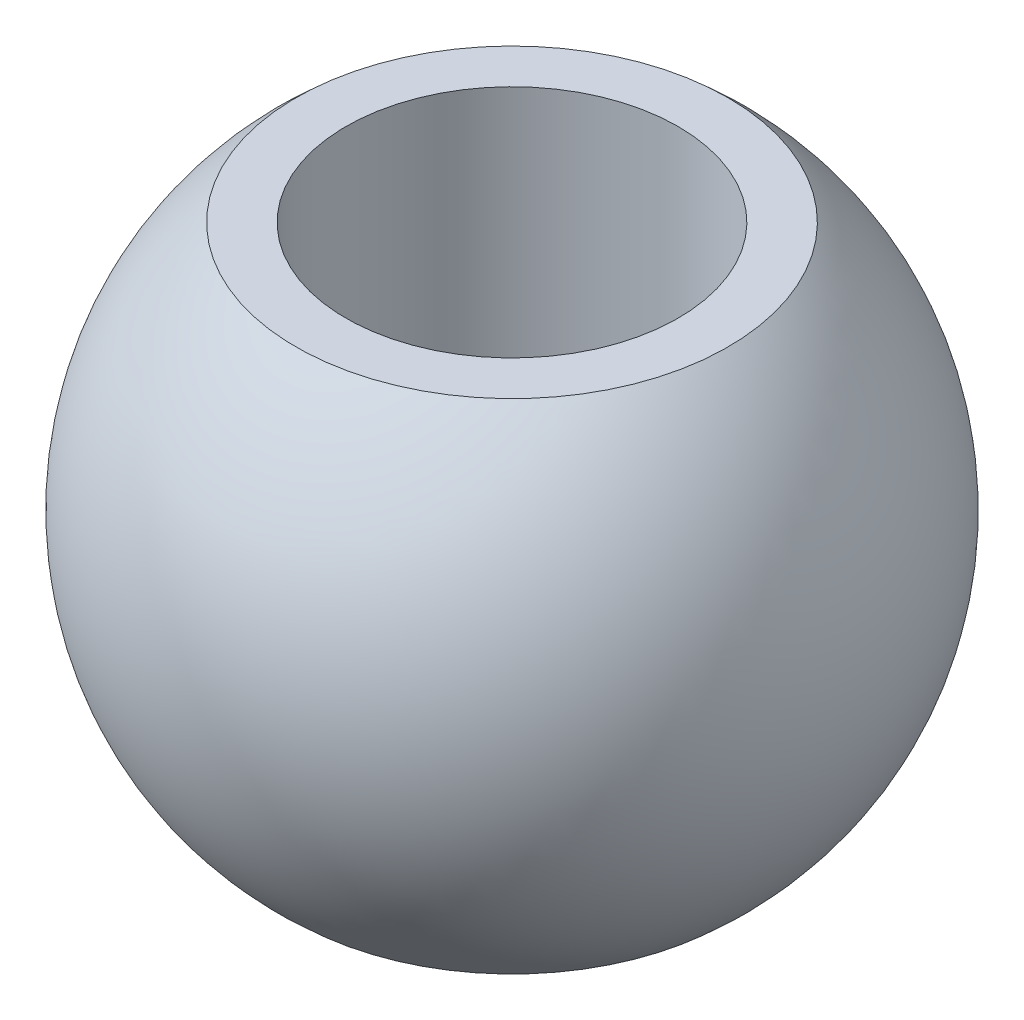
ISO-10303-21;
HEADER;
FILE_DESCRIPTION(('STEP AP214'),'2;1');
FILE_NAME('part.step','',(''),(''),'','','');
FILE_SCHEMA(('AUTOMOTIVE_DESIGN { 1 0 10303 214 1 1 1 1 }'));
ENDSEC;
DATA;
#1=APPLICATION_CONTEXT('core data for automotive mechanical design processes');
#2=APPLICATION_PROTOCOL_DEFINITION('international standard','automotive_design',2000,#1);
#3=PRODUCT_CONTEXT('',#1,'mechanical');
#4=PRODUCT('Part','Part','',(#3));
#5=PRODUCT_RELATED_PRODUCT_CATEGORY('part','',(#4));
#6=PRODUCT_DEFINITION_FORMATION('','',#4);
#7=PRODUCT_DEFINITION_CONTEXT('part definition',#1,'design');
#8=PRODUCT_DEFINITION('design','',#6,#7);
#9=PRODUCT_DEFINITION_SHAPE('','',#8);
#10=(LENGTH_UNIT() NAMED_UNIT(*) SI_UNIT(.MILLI.,.METRE.));
#11=(NAMED_UNIT(*) PLANE_ANGLE_UNIT() SI_UNIT($,.RADIAN.));
#12=(NAMED_UNIT(*) SI_UNIT($,.STERADIAN.) SOLID_ANGLE_UNIT());
#13=UNCERTAINTY_MEASURE_WITH_UNIT(LENGTH_MEASURE(1.E-05),#10,'distance_accuracy_value','');
#14=(GEOMETRIC_REPRESENTATION_CONTEXT(3) GLOBAL_UNCERTAINTY_ASSIGNED_CONTEXT((#13)) GLOBAL_UNIT_ASSIGNED_CONTEXT((#10,
#11,#12)) REPRESENTATION_CONTEXT('',''));
#15=CARTESIAN_POINT('',(0.,0.,0.));
#16=DIRECTION('',(0.,0.,1.));
#17=DIRECTION('',(1.,0.,0.));
#18=AXIS2_PLACEMENT_3D('',#15,#16,#17);
#19=CARTESIAN_POINT('',(4.,-6.,0.));
#20=DIRECTION('',(0.,-1.,0.));
#21=DIRECTION('',(0.,0.,-1.));
#22=AXIS2_PLACEMENT_3D('',#19,#20,#21);
#23=PLANE('',#22);
#24=CARTESIAN_POINT('',(0.,-6.,0.));
#25=DIRECTION('',(0.,-1.,0.));
#26=DIRECTION('',(0.,0.,-1.));
#27=AXIS2_PLACEMENT_3D('',#24,#25,#26);
#28=CIRCLE('',#27,5.20034614232553);
#29=CARTESIAN_POINT('',(0.,-6.,-5.20034614232553));
#30=VERTEX_POINT('',#29);
#31=EDGE_CURVE('E10',#30,#30,#28,.T.);
#32=ORIENTED_EDGE('',*,*,#31,.T.);
#33=EDGE_LOOP('',(#32));
#34=FACE_BOUND('',#33,.T.);
#35=CARTESIAN_POINT('',(0.,-6.,0.));
#36=DIRECTION('',(0.,-1.,0.));
#37=DIRECTION('',(0.,0.,-1.));
#38=AXIS2_PLACEMENT_3D('',#35,#36,#37);
#39=CIRCLE('',#38,4.);
#40=CARTESIAN_POINT('',(0.,-6.,-4.));
#41=VERTEX_POINT('',#40);
#42=EDGE_CURVE('E45',#41,#41,#39,.T.);
#43=ORIENTED_EDGE('',*,*,#42,.F.);
#44=EDGE_LOOP('',(#43));
#45=FACE_BOUND('',#44,.T.);
#46=ADVANCED_FACE('F31',(#34,#45),#23,.T.);
#47=CARTESIAN_POINT('',(0.,0.,0.));
#48=DIRECTION('',(0.,-1.,0.));
#49=DIRECTION('',(1.,0.,0.));
#50=AXIS2_PLACEMENT_3D('',#47,#48,#49);
#51=SPHERICAL_SURFACE('',#50,7.94);
#52=CARTESIAN_POINT('',(0.,6.,0.));
#53=DIRECTION('',(0.,-1.,0.));
#54=DIRECTION('',(0.,0.,-1.));
#55=AXIS2_PLACEMENT_3D('',#52,#53,#54);
#56=CIRCLE('',#55,5.20034614232553);
#57=CARTESIAN_POINT('',(0.,6.,-5.20034614232553));
#58=VERTEX_POINT('',#57);
#59=EDGE_CURVE('E37',#58,#58,#56,.T.);
#60=ORIENTED_EDGE('',*,*,#59,.T.);
#61=EDGE_LOOP('',(#60));
#62=FACE_BOUND('',#61,.T.);
#63=ORIENTED_EDGE('',*,*,#31,.F.);
#64=EDGE_LOOP('',(#63));
#65=FACE_BOUND('',#64,.T.);
#66=ADVANCED_FACE('F55',(#62,#65),#51,.T.);
#67=CARTESIAN_POINT('',(4.,6.,0.));
#68=DIRECTION('',(0.,1.,0.));
#69=DIRECTION('',(0.,0.,1.));
#70=AXIS2_PLACEMENT_3D('',#67,#68,#69);
#71=PLANE('',#70);
#72=CARTESIAN_POINT('',(0.,6.,0.));
#73=DIRECTION('',(0.,-1.,0.));
#74=DIRECTION('',(0.,0.,-1.));
#75=AXIS2_PLACEMENT_3D('',#72,#73,#74);
#76=CIRCLE('',#75,4.);
#77=CARTESIAN_POINT('',(0.,6.,-4.));
#78=VERTEX_POINT('',#77);
#79=EDGE_CURVE('E41',#78,#78,#76,.T.);
#80=ORIENTED_EDGE('',*,*,#79,.T.);
#81=EDGE_LOOP('',(#80));
#82=FACE_BOUND('',#81,.T.);
#83=ORIENTED_EDGE('',*,*,#59,.F.);
#84=EDGE_LOOP('',(#83));
#85=FACE_BOUND('',#84,.T.);
#86=ADVANCED_FACE('F59',(#82,#85),#71,.T.);
#87=CARTESIAN_POINT('',(0.,-11.1,0.));
#88=DIRECTION('',(0.,-1.,0.));
#89=DIRECTION('',(0.,0.,-1.));
#90=AXIS2_PLACEMENT_3D('',#87,#88,#89);
#91=CYLINDRICAL_SURFACE('',#90,4.);
#92=ORIENTED_EDGE('',*,*,#42,.T.);
#93=EDGE_LOOP('',(#92));
#94=FACE_BOUND('',#93,.T.);
#95=ORIENTED_EDGE('',*,*,#79,.F.);
#96=EDGE_LOOP('',(#95));
#97=FACE_BOUND('',#96,.T.);
#98=ADVANCED_FACE('F51',(#94,#97),#91,.F.);
#99=CLOSED_SHELL('',(#46,#66,#86,#98));
#100=MANIFOLD_SOLID_BREP('B2',#99);
#101=ADVANCED_BREP_SHAPE_REPRESENTATION('',(#18,#100),#14);
#102=SHAPE_DEFINITION_REPRESENTATION(#9,#101);
ENDSEC;
END-ISO-10303-21;
